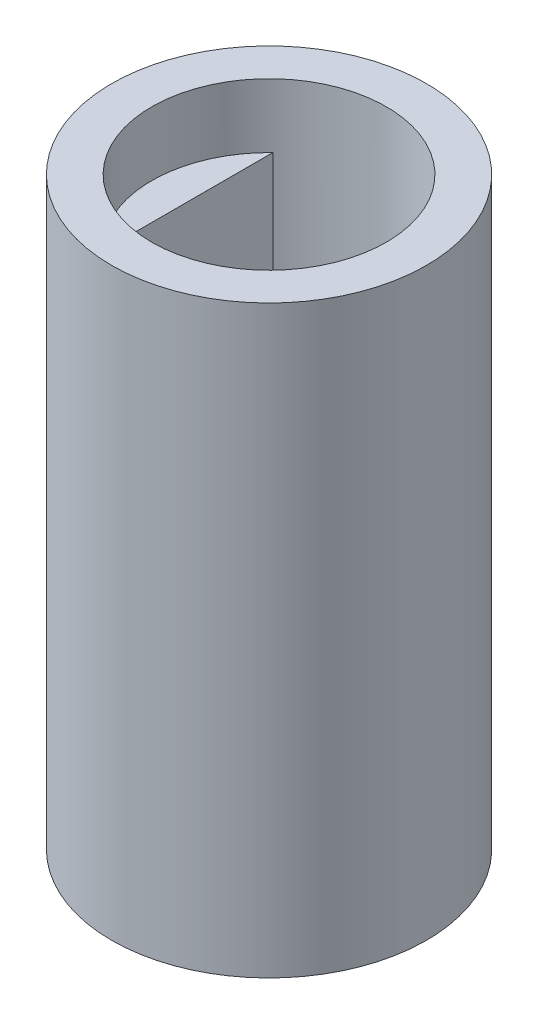
ISO-10303-21;
HEADER;
FILE_DESCRIPTION(('STEP AP214'),'2;1');
FILE_NAME('part.step','',(''),(''),'','','');
FILE_SCHEMA(('AUTOMOTIVE_DESIGN { 1 0 10303 214 1 1 1 1 }'));
ENDSEC;
DATA;
#1=APPLICATION_CONTEXT('core data for automotive mechanical design processes');
#2=APPLICATION_PROTOCOL_DEFINITION('international standard','automotive_design',2000,#1);
#3=PRODUCT_CONTEXT('',#1,'mechanical');
#4=PRODUCT('Part','Part','',(#3));
#5=PRODUCT_RELATED_PRODUCT_CATEGORY('part','',(#4));
#6=PRODUCT_DEFINITION_FORMATION('','',#4);
#7=PRODUCT_DEFINITION_CONTEXT('part definition',#1,'design');
#8=PRODUCT_DEFINITION('design','',#6,#7);
#9=PRODUCT_DEFINITION_SHAPE('','',#8);
#10=(LENGTH_UNIT() NAMED_UNIT(*) SI_UNIT(.MILLI.,.METRE.));
#11=(NAMED_UNIT(*) PLANE_ANGLE_UNIT() SI_UNIT($,.RADIAN.));
#12=(NAMED_UNIT(*) SI_UNIT($,.STERADIAN.) SOLID_ANGLE_UNIT());
#13=UNCERTAINTY_MEASURE_WITH_UNIT(LENGTH_MEASURE(1.E-05),#10,'distance_accuracy_value','');
#14=(GEOMETRIC_REPRESENTATION_CONTEXT(3) GLOBAL_UNCERTAINTY_ASSIGNED_CONTEXT((#13)) GLOBAL_UNIT_ASSIGNED_CONTEXT((#10,
#11,#12)) REPRESENTATION_CONTEXT('',''));
#15=CARTESIAN_POINT('',(0.,0.,0.));
#16=DIRECTION('',(0.,0.,1.));
#17=DIRECTION('',(1.,0.,0.));
#18=AXIS2_PLACEMENT_3D('',#15,#16,#17);
#19=CARTESIAN_POINT('',(-32.2560653814,5.,12.9857265192457));
#20=DIRECTION('',(0.,-1.,0.));
#21=DIRECTION('',(0.,0.,-1.));
#22=AXIS2_PLACEMENT_3D('',#19,#20,#21);
#23=CYLINDRICAL_SURFACE('',#22,0.75);
#24=DIRECTION('',(0.,-1.,0.));
#25=VECTOR('',#24,1.);
#26=CARTESIAN_POINT('',(-31.5060653814,5.,12.9857265192457));
#27=LINE('',#26,#25);
#28=CARTESIAN_POINT('',(-31.5060653814,5.,12.9857265192457));
#29=VERTEX_POINT('',#28);
#30=CARTESIAN_POINT('',(-31.5060653814,0.,12.9857265192457));
#31=VERTEX_POINT('',#30);
#32=EDGE_CURVE('E285',#29,#31,#27,.T.);
#33=ORIENTED_EDGE('',*,*,#32,.F.);
#34=CARTESIAN_POINT('',(-32.2560653814,5.,12.9857265192457));
#35=DIRECTION('',(0.,1.,0.));
#36=DIRECTION('',(0.,0.,1.));
#37=AXIS2_PLACEMENT_3D('',#34,#35,#36);
#38=CIRCLE('',#37,0.75);
#39=CARTESIAN_POINT('',(-32.2560653814,5.,13.7357265192457));
#40=VERTEX_POINT('',#39);
#41=EDGE_CURVE('E39',#40,#29,#38,.T.);
#42=ORIENTED_EDGE('',*,*,#41,.F.);
#43=DIRECTION('',(0.,-1.,0.));
#44=VECTOR('',#43,1.);
#45=CARTESIAN_POINT('',(-32.2560653814,5.,13.7357265192457));
#46=LINE('',#45,#44);
#47=CARTESIAN_POINT('',(-32.2560653814,0.,13.7357265192457));
#48=VERTEX_POINT('',#47);
#49=EDGE_CURVE('E288',#48,#40,#46,.F.);
#50=ORIENTED_EDGE('',*,*,#49,.F.);
#51=CARTESIAN_POINT('',(-32.2560653814,0.,12.9857265192457));
#52=DIRECTION('',(0.,1.,0.));
#53=DIRECTION('',(0.,0.,1.));
#54=AXIS2_PLACEMENT_3D('',#51,#52,#53);
#55=CIRCLE('',#54,0.75);
#56=EDGE_CURVE('E11',#31,#48,#55,.F.);
#57=ORIENTED_EDGE('',*,*,#56,.F.);
#58=EDGE_LOOP('',(#33,#42,#50,#57));
#59=FACE_BOUND('',#58,.T.);
#60=ADVANCED_FACE('F32',(#59),#23,.T.);
#61=CARTESIAN_POINT('',(-28.8560653814,5.,16.3857265192457));
#62=DIRECTION('',(0.,1.,0.));
#63=DIRECTION('',(0.,0.,1.));
#64=AXIS2_PLACEMENT_3D('',#61,#62,#63);
#65=CYLINDRICAL_SURFACE('',#64,0.75);
#66=DIRECTION('',(0.,1.,0.));
#67=VECTOR('',#66,1.);
#68=CARTESIAN_POINT('',(-28.8560653814,5.,15.6357265192457));
#69=LINE('',#68,#67);
#70=CARTESIAN_POINT('',(-28.8560653814,0.,15.6357265192457));
#71=VERTEX_POINT('',#70);
#72=CARTESIAN_POINT('',(-28.8560653814,5.,15.6357265192457));
#73=VERTEX_POINT('',#72);
#74=EDGE_CURVE('E275',#71,#73,#69,.T.);
#75=ORIENTED_EDGE('',*,*,#74,.F.);
#76=CARTESIAN_POINT('',(-28.8560653814,0.,16.3857265192457));
#77=DIRECTION('',(0.,1.,0.));
#78=DIRECTION('',(0.,0.,1.));
#79=AXIS2_PLACEMENT_3D('',#76,#77,#78);
#80=CIRCLE('',#79,0.75);
#81=CARTESIAN_POINT('',(-29.6060653814,0.,16.3857265192457));
#82=VERTEX_POINT('',#81);
#83=EDGE_CURVE('E281',#82,#71,#80,.F.);
#84=ORIENTED_EDGE('',*,*,#83,.F.);
#85=DIRECTION('',(0.,1.,0.));
#86=VECTOR('',#85,1.);
#87=CARTESIAN_POINT('',(-29.6060653814,5.,16.3857265192457));
#88=LINE('',#87,#86);
#89=CARTESIAN_POINT('',(-29.6060653814,5.,16.3857265192457));
#90=VERTEX_POINT('',#89);
#91=EDGE_CURVE('E278',#90,#82,#88,.F.);
#92=ORIENTED_EDGE('',*,*,#91,.F.);
#93=CARTESIAN_POINT('',(-28.8560653814,5.,16.3857265192457));
#94=DIRECTION('',(0.,1.,0.));
#95=DIRECTION('',(0.,0.,1.));
#96=AXIS2_PLACEMENT_3D('',#93,#94,#95);
#97=CIRCLE('',#96,0.75);
#98=EDGE_CURVE('E283',#73,#90,#97,.T.);
#99=ORIENTED_EDGE('',*,*,#98,.F.);
#100=EDGE_LOOP('',(#75,#84,#92,#99));
#101=FACE_BOUND('',#100,.T.);
#102=ADVANCED_FACE('F425',(#101),#65,.T.);
#103=CARTESIAN_POINT('',(-28.8560653814,5.,12.9857265192457));
#104=DIRECTION('',(0.,1.,0.));
#105=DIRECTION('',(0.,0.,1.));
#106=AXIS2_PLACEMENT_3D('',#103,#104,#105);
#107=CYLINDRICAL_SURFACE('',#106,0.75);
#108=DIRECTION('',(0.,-1.,0.));
#109=VECTOR('',#108,1.);
#110=CARTESIAN_POINT('',(-28.8560653814,5.,13.7357265192457));
#111=LINE('',#110,#109);
#112=CARTESIAN_POINT('',(-28.8560653814,5.,13.7357265192457));
#113=VERTEX_POINT('',#112);
#114=CARTESIAN_POINT('',(-28.8560653814,0.,13.7357265192457));
#115=VERTEX_POINT('',#114);
#116=EDGE_CURVE('E265',#113,#115,#111,.T.);
#117=ORIENTED_EDGE('',*,*,#116,.F.);
#118=CARTESIAN_POINT('',(-28.8560653814,5.,12.9857265192457));
#119=DIRECTION('',(0.,1.,0.));
#120=DIRECTION('',(0.,0.,1.));
#121=AXIS2_PLACEMENT_3D('',#118,#119,#120);
#122=CIRCLE('',#121,0.75);
#123=CARTESIAN_POINT('',(-29.6060653814,5.,12.9857265192457));
#124=VERTEX_POINT('',#123);
#125=EDGE_CURVE('E271',#124,#113,#122,.T.);
#126=ORIENTED_EDGE('',*,*,#125,.F.);
#127=DIRECTION('',(0.,-1.,0.));
#128=VECTOR('',#127,1.);
#129=CARTESIAN_POINT('',(-29.6060653814,5.,12.9857265192457));
#130=LINE('',#129,#128);
#131=CARTESIAN_POINT('',(-29.6060653814,0.,12.9857265192457));
#132=VERTEX_POINT('',#131);
#133=EDGE_CURVE('E268',#132,#124,#130,.F.);
#134=ORIENTED_EDGE('',*,*,#133,.F.);
#135=CARTESIAN_POINT('',(-28.8560653814,0.,12.9857265192457));
#136=DIRECTION('',(0.,1.,0.));
#137=DIRECTION('',(0.,0.,1.));
#138=AXIS2_PLACEMENT_3D('',#135,#136,#137);
#139=CIRCLE('',#138,0.75);
#140=EDGE_CURVE('E273',#115,#132,#139,.F.);
#141=ORIENTED_EDGE('',*,*,#140,.F.);
#142=EDGE_LOOP('',(#117,#126,#134,#141));
#143=FACE_BOUND('',#142,.T.);
#144=ADVANCED_FACE('F375',(#143),#107,.T.);
#145=CARTESIAN_POINT('',(-32.2560653814,5.,16.3857265192457));
#146=DIRECTION('',(0.,-1.,0.));
#147=DIRECTION('',(0.,0.,-1.));
#148=AXIS2_PLACEMENT_3D('',#145,#146,#147);
#149=CYLINDRICAL_SURFACE('',#148,0.75);
#150=DIRECTION('',(0.,1.,0.));
#151=VECTOR('',#150,1.);
#152=CARTESIAN_POINT('',(-31.5060653814,5.,16.3857265192457));
#153=LINE('',#152,#151);
#154=CARTESIAN_POINT('',(-31.5060653814,0.,16.3857265192457));
#155=VERTEX_POINT('',#154);
#156=CARTESIAN_POINT('',(-31.5060653814,5.,16.3857265192457));
#157=VERTEX_POINT('',#156);
#158=EDGE_CURVE('E254',#155,#157,#153,.T.);
#159=ORIENTED_EDGE('',*,*,#158,.F.);
#160=CARTESIAN_POINT('',(-32.2560653814,0.,16.3857265192457));
#161=DIRECTION('',(0.,1.,0.));
#162=DIRECTION('',(0.,0.,1.));
#163=AXIS2_PLACEMENT_3D('',#160,#161,#162);
#164=CIRCLE('',#163,0.75);
#165=CARTESIAN_POINT('',(-32.2560653814,0.,15.6357265192457));
#166=VERTEX_POINT('',#165);
#167=EDGE_CURVE('E261',#166,#155,#164,.F.);
#168=ORIENTED_EDGE('',*,*,#167,.F.);
#169=DIRECTION('',(0.,1.,0.));
#170=VECTOR('',#169,1.);
#171=CARTESIAN_POINT('',(-32.2560653814,5.,15.6357265192457));
#172=LINE('',#171,#170);
#173=CARTESIAN_POINT('',(-32.2560653814,5.,15.6357265192457));
#174=VERTEX_POINT('',#173);
#175=EDGE_CURVE('E259',#174,#166,#172,.F.);
#176=ORIENTED_EDGE('',*,*,#175,.F.);
#177=CARTESIAN_POINT('',(-32.2560653814,5.,16.3857265192457));
#178=DIRECTION('',(0.,1.,0.));
#179=DIRECTION('',(0.,0.,1.));
#180=AXIS2_PLACEMENT_3D('',#177,#178,#179);
#181=CIRCLE('',#180,0.75);
#182=EDGE_CURVE('E263',#157,#174,#181,.T.);
#183=ORIENTED_EDGE('',*,*,#182,.F.);
#184=EDGE_LOOP('',(#159,#168,#176,#183));
#185=FACE_BOUND('',#184,.T.);
#186=ADVANCED_FACE('F433',(#185),#149,.T.);
#187=CARTESIAN_POINT('',(0.,5.,0.));
#188=DIRECTION('',(0.,1.,0.));
#189=DIRECTION('',(0.,0.,1.));
#190=AXIS2_PLACEMENT_3D('',#187,#188,#189);
#191=PLANE('',#190);
#192=DIRECTION('',(-1.,0.,0.));
#193=VECTOR('',#192,1.);
#194=CARTESIAN_POINT('',(0.,5.,15.6357265192457));
#195=LINE('',#194,#193);
#196=CARTESIAN_POINT('',(-28.6560653814,5.,15.6357265192457));
#197=VERTEX_POINT('',#196);
#198=EDGE_CURVE('E317',#197,#73,#195,.T.);
#199=ORIENTED_EDGE('',*,*,#198,.T.);
#200=ORIENTED_EDGE('',*,*,#98,.T.);
#201=DIRECTION('',(0.,0.,1.));
#202=VECTOR('',#201,1.);
#203=CARTESIAN_POINT('',(-29.6060653814,5.,0.));
#204=LINE('',#203,#202);
#205=CARTESIAN_POINT('',(-29.6060653814,5.,17.1357265192457));
#206=VERTEX_POINT('',#205);
#207=EDGE_CURVE('E212',#90,#206,#204,.T.);
#208=ORIENTED_EDGE('',*,*,#207,.T.);
#209=DIRECTION('',(-1.,0.,0.));
#210=VECTOR('',#209,1.);
#211=CARTESIAN_POINT('',(0.,5.,17.1357265192457));
#212=LINE('',#211,#210);
#213=CARTESIAN_POINT('',(-31.5060653814,5.,17.1357265192457));
#214=VERTEX_POINT('',#213);
#215=EDGE_CURVE('E207',#206,#214,#212,.T.);
#216=ORIENTED_EDGE('',*,*,#215,.T.);
#217=DIRECTION('',(0.,0.,1.));
#218=VECTOR('',#217,1.);
#219=CARTESIAN_POINT('',(-31.5060653814,5.,0.));
#220=LINE('',#219,#218);
#221=EDGE_CURVE('E190',#157,#214,#220,.T.);
#222=ORIENTED_EDGE('',*,*,#221,.F.);
#223=ORIENTED_EDGE('',*,*,#182,.T.);
#224=DIRECTION('',(-1.,0.,0.));
#225=VECTOR('',#224,1.);
#226=CARTESIAN_POINT('',(0.,5.,15.6357265192457));
#227=LINE('',#226,#225);
#228=CARTESIAN_POINT('',(-32.4560653814,5.,15.6357265192457));
#229=VERTEX_POINT('',#228);
#230=EDGE_CURVE('E189',#174,#229,#227,.T.);
#231=ORIENTED_EDGE('',*,*,#230,.T.);
#232=DIRECTION('',(0.,0.,-1.));
#233=VECTOR('',#232,1.);
#234=CARTESIAN_POINT('',(-32.4560653814,5.,0.));
#235=LINE('',#234,#233);
#236=CARTESIAN_POINT('',(-32.4560653814,5.,16.6738160544529));
#237=VERTEX_POINT('',#236);
#238=EDGE_CURVE('E216',#237,#229,#235,.T.);
#239=ORIENTED_EDGE('',*,*,#238,.F.);
#240=CARTESIAN_POINT('',(-30.5560653814,5.,14.6857265192457));
#241=DIRECTION('',(0.,1.,0.));
#242=DIRECTION('',(0.,0.,1.));
#243=AXIS2_PLACEMENT_3D('',#240,#241,#242);
#244=CIRCLE('',#243,2.75);
#245=CARTESIAN_POINT('',(-28.6560653814,5.,16.6738160544528));
#246=VERTEX_POINT('',#245);
#247=EDGE_CURVE('E218',#237,#246,#244,.T.);
#248=ORIENTED_EDGE('',*,*,#247,.T.);
#249=DIRECTION('',(0.,0.,-1.));
#250=VECTOR('',#249,1.);
#251=CARTESIAN_POINT('',(-28.6560653814,5.,0.));
#252=LINE('',#251,#250);
#253=EDGE_CURVE('E224',#246,#197,#252,.T.);
#254=ORIENTED_EDGE('',*,*,#253,.T.);
#255=EDGE_LOOP('',(#199,#200,#208,#216,#222,#223,#231,#239,#248,#254));
#256=FACE_BOUND('',#255,.T.);
#257=ADVANCED_FACE('F397',(#256),#191,.T.);
#258=CARTESIAN_POINT('',(-30.5560653814,0.,14.6857265192457));
#259=DIRECTION('',(0.,1.,0.));
#260=DIRECTION('',(0.,0.,1.));
#261=AXIS2_PLACEMENT_3D('',#258,#259,#260);
#262=PLANE('',#261);
#263=CARTESIAN_POINT('',(-30.5560653814,0.,14.6857265192457));
#264=DIRECTION('',(0.,1.,0.));
#265=DIRECTION('',(0.,0.,1.));
#266=AXIS2_PLACEMENT_3D('',#263,#264,#265);
#267=CIRCLE('',#266,3.69);
#268=CARTESIAN_POINT('',(-30.5560653814,0.,18.3757265192457));
#269=VERTEX_POINT('',#268);
#270=EDGE_CURVE('E247',#269,#269,#267,.T.);
#271=ORIENTED_EDGE('',*,*,#270,.F.);
#272=EDGE_LOOP('',(#271));
#273=FACE_BOUND('',#272,.T.);
#274=DIRECTION('',(0.,0.,1.));
#275=VECTOR('',#274,1.);
#276=CARTESIAN_POINT('',(-31.5060653814,0.,0.));
#277=LINE('',#276,#275);
#278=CARTESIAN_POINT('',(-31.5060653814,0.,12.2357265192457));
#279=VERTEX_POINT('',#278);
#280=EDGE_CURVE('E329',#279,#31,#277,.T.);
#281=ORIENTED_EDGE('',*,*,#280,.T.);
#282=ORIENTED_EDGE('',*,*,#56,.T.);
#283=DIRECTION('',(-1.,0.,0.));
#284=VECTOR('',#283,1.);
#285=CARTESIAN_POINT('',(0.,0.,13.7357265192457));
#286=LINE('',#285,#284);
#287=CARTESIAN_POINT('',(-33.0060653814,0.,13.7357265192457));
#288=VERTEX_POINT('',#287);
#289=EDGE_CURVE('E327',#48,#288,#286,.T.);
#290=ORIENTED_EDGE('',*,*,#289,.T.);
#291=DIRECTION('',(0.,0.,1.));
#292=VECTOR('',#291,1.);
#293=CARTESIAN_POINT('',(-33.0060653814,0.,0.));
#294=LINE('',#293,#292);
#295=CARTESIAN_POINT('',(-33.0060653814,0.,15.6357265192457));
#296=VERTEX_POINT('',#295);
#297=EDGE_CURVE('E325',#288,#296,#294,.T.);
#298=ORIENTED_EDGE('',*,*,#297,.T.);
#299=DIRECTION('',(-1.,0.,0.));
#300=VECTOR('',#299,1.);
#301=CARTESIAN_POINT('',(0.,0.,15.6357265192457));
#302=LINE('',#301,#300);
#303=EDGE_CURVE('E206',#166,#296,#302,.T.);
#304=ORIENTED_EDGE('',*,*,#303,.F.);
#305=ORIENTED_EDGE('',*,*,#167,.T.);
#306=DIRECTION('',(0.,0.,1.));
#307=VECTOR('',#306,1.);
#308=CARTESIAN_POINT('',(-31.5060653814,0.,0.));
#309=LINE('',#308,#307);
#310=CARTESIAN_POINT('',(-31.5060653814,0.,17.1357265192457));
#311=VERTEX_POINT('',#310);
#312=EDGE_CURVE('E322',#155,#311,#309,.T.);
#313=ORIENTED_EDGE('',*,*,#312,.T.);
#314=DIRECTION('',(-1.,0.,0.));
#315=VECTOR('',#314,1.);
#316=CARTESIAN_POINT('',(0.,0.,17.1357265192457));
#317=LINE('',#316,#315);
#318=CARTESIAN_POINT('',(-29.6060653814,0.,17.1357265192457));
#319=VERTEX_POINT('',#318);
#320=EDGE_CURVE('E348',#319,#311,#317,.T.);
#321=ORIENTED_EDGE('',*,*,#320,.F.);
#322=DIRECTION('',(0.,0.,1.));
#323=VECTOR('',#322,1.);
#324=CARTESIAN_POINT('',(-29.6060653814,0.,0.));
#325=LINE('',#324,#323);
#326=EDGE_CURVE('E346',#82,#319,#325,.T.);
#327=ORIENTED_EDGE('',*,*,#326,.F.);
#328=ORIENTED_EDGE('',*,*,#83,.T.);
#329=DIRECTION('',(-1.,0.,0.));
#330=VECTOR('',#329,1.);
#331=CARTESIAN_POINT('',(0.,0.,15.6357265192457));
#332=LINE('',#331,#330);
#333=CARTESIAN_POINT('',(-28.1060653814,0.,15.6357265192457));
#334=VERTEX_POINT('',#333);
#335=EDGE_CURVE('E343',#334,#71,#332,.T.);
#336=ORIENTED_EDGE('',*,*,#335,.F.);
#337=DIRECTION('',(0.,0.,1.));
#338=VECTOR('',#337,1.);
#339=CARTESIAN_POINT('',(-28.1060653814,0.,0.));
#340=LINE('',#339,#338);
#341=CARTESIAN_POINT('',(-28.1060653814,0.,13.7357265192457));
#342=VERTEX_POINT('',#341);
#343=EDGE_CURVE('E340',#342,#334,#340,.T.);
#344=ORIENTED_EDGE('',*,*,#343,.F.);
#345=DIRECTION('',(-1.,0.,0.));
#346=VECTOR('',#345,1.);
#347=CARTESIAN_POINT('',(0.,0.,13.7357265192457));
#348=LINE('',#347,#346);
#349=EDGE_CURVE('E337',#342,#115,#348,.T.);
#350=ORIENTED_EDGE('',*,*,#349,.T.);
#351=ORIENTED_EDGE('',*,*,#140,.T.);
#352=DIRECTION('',(0.,0.,1.));
#353=VECTOR('',#352,1.);
#354=CARTESIAN_POINT('',(-29.6060653814,0.,0.));
#355=LINE('',#354,#353);
#356=CARTESIAN_POINT('',(-29.6060653814,0.,12.2357265192457));
#357=VERTEX_POINT('',#356);
#358=EDGE_CURVE('E334',#357,#132,#355,.T.);
#359=ORIENTED_EDGE('',*,*,#358,.F.);
#360=DIRECTION('',(-1.,0.,0.));
#361=VECTOR('',#360,1.);
#362=CARTESIAN_POINT('',(0.,0.,12.2357265192457));
#363=LINE('',#362,#361);
#364=EDGE_CURVE('E331',#357,#279,#363,.T.);
#365=ORIENTED_EDGE('',*,*,#364,.T.);
#366=EDGE_LOOP('',(#281,#282,#290,#298,#304,#305,#313,#321,#327,#328,#336,#344,#350,#351,#359,#365));
#367=FACE_BOUND('',#366,.T.);
#368=ADVANCED_FACE('F365',(#273,#367),#262,.F.);
#369=CARTESIAN_POINT('',(-30.5560653814,12.2,14.6857265192457));
#370=DIRECTION('',(0.,1.,0.));
#371=DIRECTION('',(0.,0.,1.));
#372=AXIS2_PLACEMENT_3D('',#369,#370,#371);
#373=PLANE('',#372);
#374=CARTESIAN_POINT('',(-30.5560653814,12.2,14.6857265192457));
#375=DIRECTION('',(0.,1.,0.));
#376=DIRECTION('',(0.,0.,1.));
#377=AXIS2_PLACEMENT_3D('',#374,#375,#376);
#378=CIRCLE('',#377,2.75);
#379=CARTESIAN_POINT('',(-32.4560653814,12.2,12.6976369840386));
#380=VERTEX_POINT('',#379);
#381=CARTESIAN_POINT('',(-32.4560653814,12.2,16.6738160544529));
#382=VERTEX_POINT('',#381);
#383=EDGE_CURVE('E248',#380,#382,#378,.T.);
#384=ORIENTED_EDGE('',*,*,#383,.T.);
#385=DIRECTION('',(0.,0.,-1.));
#386=VECTOR('',#385,1.);
#387=CARTESIAN_POINT('',(-32.4560653814,12.2,0.));
#388=LINE('',#387,#386);
#389=EDGE_CURVE('E228',#382,#380,#388,.T.);
#390=ORIENTED_EDGE('',*,*,#389,.T.);
#391=EDGE_LOOP('',(#384,#390));
#392=FACE_BOUND('',#391,.T.);
#393=ADVANCED_FACE('F412',(#392),#373,.T.);
#394=CARTESIAN_POINT('',(-30.5560653814,13.7,14.6857265192457));
#395=DIRECTION('',(0.,-1.,0.));
#396=DIRECTION('',(0.,0.,-1.));
#397=AXIS2_PLACEMENT_3D('',#394,#395,#396);
#398=CYLINDRICAL_SURFACE('',#397,3.69);
#399=CARTESIAN_POINT('',(-30.5560653814,13.7,14.6857265192457));
#400=DIRECTION('',(0.,1.,0.));
#401=DIRECTION('',(0.,0.,1.));
#402=AXIS2_PLACEMENT_3D('',#399,#400,#401);
#403=CIRCLE('',#402,3.69);
#404=CARTESIAN_POINT('',(-30.5560653814,13.7,18.3757265192457));
#405=VERTEX_POINT('',#404);
#406=EDGE_CURVE('E251',#405,#405,#403,.T.);
#407=ORIENTED_EDGE('',*,*,#406,.F.);
#408=EDGE_LOOP('',(#407));
#409=FACE_BOUND('',#408,.T.);
#410=ORIENTED_EDGE('',*,*,#270,.T.);
#411=EDGE_LOOP('',(#410));
#412=FACE_BOUND('',#411,.T.);
#413=ADVANCED_FACE('F422',(#409,#412),#398,.T.);
#414=CARTESIAN_POINT('',(-30.5560653814,13.7,14.6857265192457));
#415=DIRECTION('',(0.,1.,0.));
#416=DIRECTION('',(0.,0.,1.));
#417=AXIS2_PLACEMENT_3D('',#414,#415,#416);
#418=PLANE('',#417);
#419=CARTESIAN_POINT('',(-30.5560653814,13.7,14.6857265192457));
#420=DIRECTION('',(0.,1.,0.));
#421=DIRECTION('',(0.,0.,1.));
#422=AXIS2_PLACEMENT_3D('',#419,#420,#421);
#423=CIRCLE('',#422,2.75);
#424=CARTESIAN_POINT('',(-30.5560653814,13.7,17.4357265192457));
#425=VERTEX_POINT('',#424);
#426=EDGE_CURVE('E237',#425,#425,#423,.T.);
#427=ORIENTED_EDGE('',*,*,#426,.F.);
#428=EDGE_LOOP('',(#427));
#429=FACE_BOUND('',#428,.T.);
#430=ORIENTED_EDGE('',*,*,#406,.T.);
#431=EDGE_LOOP('',(#430));
#432=FACE_BOUND('',#431,.T.);
#433=ADVANCED_FACE('F419',(#429,#432),#418,.T.);
#434=CARTESIAN_POINT('',(-30.5560653814,12.2,14.6857265192457));
#435=DIRECTION('',(0.,1.,0.));
#436=DIRECTION('',(0.,0.,1.));
#437=AXIS2_PLACEMENT_3D('',#434,#435,#436);
#438=CYLINDRICAL_SURFACE('',#437,2.75);
#439=CARTESIAN_POINT('',(-28.6560653814,12.2,16.6738160544528));
#440=VERTEX_POINT('',#439);
#441=CARTESIAN_POINT('',(-28.6560653814,12.2,12.6976369840386));
#442=VERTEX_POINT('',#441);
#443=EDGE_CURVE('E244',#440,#442,#378,.T.);
#444=ORIENTED_EDGE('',*,*,#443,.F.);
#445=DIRECTION('',(0.,1.,0.));
#446=VECTOR('',#445,1.);
#447=CARTESIAN_POINT('',(-28.6560653814,5.,16.6738160544528));
#448=LINE('',#447,#446);
#449=EDGE_CURVE('E240',#246,#440,#448,.T.);
#450=ORIENTED_EDGE('',*,*,#449,.F.);
#451=ORIENTED_EDGE('',*,*,#247,.F.);
#452=DIRECTION('',(0.,1.,0.));
#453=VECTOR('',#452,1.);
#454=CARTESIAN_POINT('',(-32.4560653814,5.,16.6738160544529));
#455=LINE('',#454,#453);
#456=EDGE_CURVE('E242',#237,#382,#455,.T.);
#457=ORIENTED_EDGE('',*,*,#456,.T.);
#458=ORIENTED_EDGE('',*,*,#383,.F.);
#459=DIRECTION('',(0.,1.,0.));
#460=VECTOR('',#459,1.);
#461=CARTESIAN_POINT('',(-32.4560653814,5.,12.6976369840386));
#462=LINE('',#461,#460);
#463=CARTESIAN_POINT('',(-32.4560653814,5.,12.6976369840386));
#464=VERTEX_POINT('',#463);
#465=EDGE_CURVE('E235',#464,#380,#462,.T.);
#466=ORIENTED_EDGE('',*,*,#465,.F.);
#467=CARTESIAN_POINT('',(-28.6560653814,5.,12.6976369840386));
#468=VERTEX_POINT('',#467);
#469=EDGE_CURVE('E223',#468,#464,#244,.T.);
#470=ORIENTED_EDGE('',*,*,#469,.F.);
#471=DIRECTION('',(0.,1.,0.));
#472=VECTOR('',#471,1.);
#473=CARTESIAN_POINT('',(-28.6560653814,5.,12.6976369840386));
#474=LINE('',#473,#472);
#475=EDGE_CURVE('E238',#468,#442,#474,.T.);
#476=ORIENTED_EDGE('',*,*,#475,.T.);
#477=EDGE_LOOP('',(#444,#450,#451,#457,#458,#466,#470,#476));
#478=FACE_BOUND('',#477,.T.);
#479=ORIENTED_EDGE('',*,*,#426,.T.);
#480=EDGE_LOOP('',(#479));
#481=FACE_BOUND('',#480,.T.);
#482=ADVANCED_FACE('F402',(#478,#481),#438,.F.);
#483=DIRECTION('',(0.,0.,-1.));
#484=VECTOR('',#483,1.);
#485=CARTESIAN_POINT('',(-28.6560653814,12.2,0.));
#486=LINE('',#485,#484);
#487=EDGE_CURVE('E231',#440,#442,#486,.T.);
#488=ORIENTED_EDGE('',*,*,#487,.F.);
#489=ORIENTED_EDGE('',*,*,#443,.T.);
#490=EDGE_LOOP('',(#488,#489));
#491=FACE_BOUND('',#490,.T.);
#492=ADVANCED_FACE('F408',(#491),#373,.T.);
#493=CARTESIAN_POINT('',(-32.4560653814,5.,0.));
#494=DIRECTION('',(1.,0.,0.));
#495=DIRECTION('',(0.,0.,-1.));
#496=AXIS2_PLACEMENT_3D('',#493,#494,#495);
#497=PLANE('',#496);
#498=ORIENTED_EDGE('',*,*,#389,.F.);
#499=ORIENTED_EDGE('',*,*,#456,.F.);
#500=ORIENTED_EDGE('',*,*,#238,.T.);
#501=CARTESIAN_POINT('',(-32.4560653814,5.,13.7357265192457));
#502=VERTEX_POINT('',#501);
#503=EDGE_CURVE('E184',#229,#502,#235,.T.);
#504=ORIENTED_EDGE('',*,*,#503,.T.);
#505=EDGE_CURVE('E219',#502,#464,#235,.T.);
#506=ORIENTED_EDGE('',*,*,#505,.T.);
#507=ORIENTED_EDGE('',*,*,#465,.T.);
#508=EDGE_LOOP('',(#498,#499,#500,#504,#506,#507));
#509=FACE_BOUND('',#508,.T.);
#510=ADVANCED_FACE('F410',(#509),#497,.T.);
#511=CARTESIAN_POINT('',(-28.6560653814,5.,0.));
#512=DIRECTION('',(1.,0.,0.));
#513=DIRECTION('',(0.,0.,-1.));
#514=AXIS2_PLACEMENT_3D('',#511,#512,#513);
#515=PLANE('',#514);
#516=ORIENTED_EDGE('',*,*,#487,.T.);
#517=ORIENTED_EDGE('',*,*,#475,.F.);
#518=CARTESIAN_POINT('',(-28.6560653814,5.,13.7357265192457));
#519=VERTEX_POINT('',#518);
#520=EDGE_CURVE('E222',#519,#468,#252,.T.);
#521=ORIENTED_EDGE('',*,*,#520,.F.);
#522=EDGE_CURVE('E227',#197,#519,#252,.T.);
#523=ORIENTED_EDGE('',*,*,#522,.F.);
#524=ORIENTED_EDGE('',*,*,#253,.F.);
#525=ORIENTED_EDGE('',*,*,#449,.T.);
#526=EDGE_LOOP('',(#516,#517,#521,#523,#524,#525));
#527=FACE_BOUND('',#526,.T.);
#528=ADVANCED_FACE('F394',(#527),#515,.F.);
#529=DIRECTION('',(-1.,0.,0.));
#530=VECTOR('',#529,1.);
#531=CARTESIAN_POINT('',(0.,5.,13.7357265192457));
#532=LINE('',#531,#530);
#533=EDGE_CURVE('E297',#40,#502,#532,.T.);
#534=ORIENTED_EDGE('',*,*,#533,.F.);
#535=ORIENTED_EDGE('',*,*,#41,.T.);
#536=DIRECTION('',(0.,0.,1.));
#537=VECTOR('',#536,1.);
#538=CARTESIAN_POINT('',(-31.5060653814,5.,0.));
#539=LINE('',#538,#537);
#540=CARTESIAN_POINT('',(-31.5060653814,5.,12.2357265192457));
#541=VERTEX_POINT('',#540);
#542=EDGE_CURVE('E295',#541,#29,#539,.T.);
#543=ORIENTED_EDGE('',*,*,#542,.F.);
#544=DIRECTION('',(-1.,0.,0.));
#545=VECTOR('',#544,1.);
#546=CARTESIAN_POINT('',(0.,5.,12.2357265192457));
#547=LINE('',#546,#545);
#548=CARTESIAN_POINT('',(-29.6060653814,5.,12.2357265192457));
#549=VERTEX_POINT('',#548);
#550=EDGE_CURVE('E302',#549,#541,#547,.T.);
#551=ORIENTED_EDGE('',*,*,#550,.F.);
#552=DIRECTION('',(0.,0.,1.));
#553=VECTOR('',#552,1.);
#554=CARTESIAN_POINT('',(-29.6060653814,5.,0.));
#555=LINE('',#554,#553);
#556=EDGE_CURVE('E304',#549,#124,#555,.T.);
#557=ORIENTED_EDGE('',*,*,#556,.T.);
#558=ORIENTED_EDGE('',*,*,#125,.T.);
#559=DIRECTION('',(-1.,0.,0.));
#560=VECTOR('',#559,1.);
#561=CARTESIAN_POINT('',(0.,5.,13.7357265192457));
#562=LINE('',#561,#560);
#563=EDGE_CURVE('E310',#519,#113,#562,.T.);
#564=ORIENTED_EDGE('',*,*,#563,.F.);
#565=ORIENTED_EDGE('',*,*,#520,.T.);
#566=ORIENTED_EDGE('',*,*,#469,.T.);
#567=ORIENTED_EDGE('',*,*,#505,.F.);
#568=EDGE_LOOP('',(#534,#535,#543,#551,#557,#558,#564,#565,#566,#567));
#569=FACE_BOUND('',#568,.T.);
#570=ADVANCED_FACE('F292',(#569),#191,.T.);
#571=CARTESIAN_POINT('',(0.,5.,0.));
#572=DIRECTION('',(0.,-1.,0.));
#573=DIRECTION('',(0.,0.,-1.));
#574=AXIS2_PLACEMENT_3D('',#571,#572,#573);
#575=PLANE('',#574);
#576=ORIENTED_EDGE('',*,*,#522,.T.);
#577=CARTESIAN_POINT('',(-28.1060653814,5.,13.7357265192457));
#578=VERTEX_POINT('',#577);
#579=EDGE_CURVE('E311',#578,#519,#562,.T.);
#580=ORIENTED_EDGE('',*,*,#579,.F.);
#581=DIRECTION('',(0.,0.,1.));
#582=VECTOR('',#581,1.);
#583=CARTESIAN_POINT('',(-28.1060653814,5.,0.));
#584=LINE('',#583,#582);
#585=CARTESIAN_POINT('',(-28.1060653814,5.,15.6357265192457));
#586=VERTEX_POINT('',#585);
#587=EDGE_CURVE('E314',#578,#586,#584,.T.);
#588=ORIENTED_EDGE('',*,*,#587,.T.);
#589=EDGE_CURVE('E318',#586,#197,#195,.T.);
#590=ORIENTED_EDGE('',*,*,#589,.T.);
#591=EDGE_LOOP('',(#576,#580,#588,#590));
#592=FACE_BOUND('',#591,.T.);
#593=ADVANCED_FACE('F382',(#592),#575,.T.);
#594=CARTESIAN_POINT('',(-31.5060653814,5.,0.));
#595=DIRECTION('',(1.,0.,0.));
#596=DIRECTION('',(0.,0.,-1.));
#597=AXIS2_PLACEMENT_3D('',#594,#595,#596);
#598=PLANE('',#597);
#599=ORIENTED_EDGE('',*,*,#312,.F.);
#600=ORIENTED_EDGE('',*,*,#158,.T.);
#601=ORIENTED_EDGE('',*,*,#221,.T.);
#602=DIRECTION('',(0.,-1.,0.));
#603=VECTOR('',#602,1.);
#604=CARTESIAN_POINT('',(-31.5060653814,5.,17.1357265192457));
#605=LINE('',#604,#603);
#606=EDGE_CURVE('E232',#214,#311,#605,.T.);
#607=ORIENTED_EDGE('',*,*,#606,.T.);
#608=EDGE_LOOP('',(#599,#600,#601,#607));
#609=FACE_BOUND('',#608,.T.);
#610=ADVANCED_FACE('F495',(#609),#598,.T.);
#611=CARTESIAN_POINT('',(0.,5.,17.1357265192457));
#612=DIRECTION('',(0.,0.,1.));
#613=DIRECTION('',(1.,0.,0.));
#614=AXIS2_PLACEMENT_3D('',#611,#612,#613);
#615=PLANE('',#614);
#616=ORIENTED_EDGE('',*,*,#320,.T.);
#617=ORIENTED_EDGE('',*,*,#606,.F.);
#618=ORIENTED_EDGE('',*,*,#215,.F.);
#619=DIRECTION('',(0.,-1.,0.));
#620=VECTOR('',#619,1.);
#621=CARTESIAN_POINT('',(-29.6060653814,5.,17.1357265192457));
#622=LINE('',#621,#620);
#623=EDGE_CURVE('E353',#206,#319,#622,.T.);
#624=ORIENTED_EDGE('',*,*,#623,.T.);
#625=EDGE_LOOP('',(#616,#617,#618,#624));
#626=FACE_BOUND('',#625,.T.);
#627=ADVANCED_FACE('F503',(#626),#615,.F.);
#628=CARTESIAN_POINT('',(-29.6060653814,5.,0.));
#629=DIRECTION('',(1.,0.,0.));
#630=DIRECTION('',(0.,0.,-1.));
#631=AXIS2_PLACEMENT_3D('',#628,#629,#630);
#632=PLANE('',#631);
#633=ORIENTED_EDGE('',*,*,#207,.F.);
#634=ORIENTED_EDGE('',*,*,#91,.T.);
#635=ORIENTED_EDGE('',*,*,#326,.T.);
#636=ORIENTED_EDGE('',*,*,#623,.F.);
#637=EDGE_LOOP('',(#633,#634,#635,#636));
#638=FACE_BOUND('',#637,.T.);
#639=ADVANCED_FACE('F508',(#638),#632,.F.);
#640=CARTESIAN_POINT('',(0.,5.,15.6357265192457));
#641=DIRECTION('',(0.,0.,1.));
#642=DIRECTION('',(1.,0.,0.));
#643=AXIS2_PLACEMENT_3D('',#640,#641,#642);
#644=PLANE('',#643);
#645=ORIENTED_EDGE('',*,*,#335,.T.);
#646=ORIENTED_EDGE('',*,*,#74,.T.);
#647=ORIENTED_EDGE('',*,*,#198,.F.);
#648=ORIENTED_EDGE('',*,*,#589,.F.);
#649=DIRECTION('',(0.,-1.,0.));
#650=VECTOR('',#649,1.);
#651=CARTESIAN_POINT('',(-28.1060653814,5.,15.6357265192457));
#652=LINE('',#651,#650);
#653=EDGE_CURVE('E356',#586,#334,#652,.T.);
#654=ORIENTED_EDGE('',*,*,#653,.T.);
#655=EDGE_LOOP('',(#645,#646,#647,#648,#654));
#656=FACE_BOUND('',#655,.T.);
#657=ADVANCED_FACE('F390',(#656),#644,.F.);
#658=CARTESIAN_POINT('',(-28.1060653814,5.,0.));
#659=DIRECTION('',(1.,0.,0.));
#660=DIRECTION('',(0.,0.,-1.));
#661=AXIS2_PLACEMENT_3D('',#658,#659,#660);
#662=PLANE('',#661);
#663=ORIENTED_EDGE('',*,*,#343,.T.);
#664=ORIENTED_EDGE('',*,*,#653,.F.);
#665=ORIENTED_EDGE('',*,*,#587,.F.);
#666=DIRECTION('',(0.,-1.,0.));
#667=VECTOR('',#666,1.);
#668=CARTESIAN_POINT('',(-28.1060653814,5.,13.7357265192457));
#669=LINE('',#668,#667);
#670=EDGE_CURVE('E358',#578,#342,#669,.T.);
#671=ORIENTED_EDGE('',*,*,#670,.T.);
#672=EDGE_LOOP('',(#663,#664,#665,#671));
#673=FACE_BOUND('',#672,.T.);
#674=ADVANCED_FACE('F385',(#673),#662,.F.);
#675=CARTESIAN_POINT('',(0.,5.,13.7357265192457));
#676=DIRECTION('',(0.,0.,1.));
#677=DIRECTION('',(1.,0.,0.));
#678=AXIS2_PLACEMENT_3D('',#675,#676,#677);
#679=PLANE('',#678);
#680=ORIENTED_EDGE('',*,*,#563,.T.);
#681=ORIENTED_EDGE('',*,*,#116,.T.);
#682=ORIENTED_EDGE('',*,*,#349,.F.);
#683=ORIENTED_EDGE('',*,*,#670,.F.);
#684=ORIENTED_EDGE('',*,*,#579,.T.);
#685=EDGE_LOOP('',(#680,#681,#682,#683,#684));
#686=FACE_BOUND('',#685,.T.);
#687=ADVANCED_FACE('F378',(#686),#679,.T.);
#688=CARTESIAN_POINT('',(-29.6060653814,5.,0.));
#689=DIRECTION('',(1.,0.,0.));
#690=DIRECTION('',(0.,0.,-1.));
#691=AXIS2_PLACEMENT_3D('',#688,#689,#690);
#692=PLANE('',#691);
#693=ORIENTED_EDGE('',*,*,#358,.T.);
#694=ORIENTED_EDGE('',*,*,#133,.T.);
#695=ORIENTED_EDGE('',*,*,#556,.F.);
#696=DIRECTION('',(0.,-1.,0.));
#697=VECTOR('',#696,1.);
#698=CARTESIAN_POINT('',(-29.6060653814,5.,12.2357265192457));
#699=LINE('',#698,#697);
#700=EDGE_CURVE('E360',#549,#357,#699,.T.);
#701=ORIENTED_EDGE('',*,*,#700,.T.);
#702=EDGE_LOOP('',(#693,#694,#695,#701));
#703=FACE_BOUND('',#702,.T.);
#704=ADVANCED_FACE('F368',(#703),#692,.F.);
#705=CARTESIAN_POINT('',(0.,5.,12.2357265192457));
#706=DIRECTION('',(0.,0.,1.));
#707=DIRECTION('',(1.,0.,0.));
#708=AXIS2_PLACEMENT_3D('',#705,#706,#707);
#709=PLANE('',#708);
#710=ORIENTED_EDGE('',*,*,#364,.F.);
#711=ORIENTED_EDGE('',*,*,#700,.F.);
#712=ORIENTED_EDGE('',*,*,#550,.T.);
#713=DIRECTION('',(0.,-1.,0.));
#714=VECTOR('',#713,1.);
#715=CARTESIAN_POINT('',(-31.5060653814,5.,12.2357265192457));
#716=LINE('',#715,#714);
#717=EDGE_CURVE('E209',#541,#279,#716,.T.);
#718=ORIENTED_EDGE('',*,*,#717,.T.);
#719=EDGE_LOOP('',(#710,#711,#712,#718));
#720=FACE_BOUND('',#719,.T.);
#721=ADVANCED_FACE('F363',(#720),#709,.T.);
#722=CARTESIAN_POINT('',(-31.5060653814,5.,0.));
#723=DIRECTION('',(1.,0.,0.));
#724=DIRECTION('',(0.,0.,-1.));
#725=AXIS2_PLACEMENT_3D('',#722,#723,#724);
#726=PLANE('',#725);
#727=ORIENTED_EDGE('',*,*,#542,.T.);
#728=ORIENTED_EDGE('',*,*,#32,.T.);
#729=ORIENTED_EDGE('',*,*,#280,.F.);
#730=ORIENTED_EDGE('',*,*,#717,.F.);
#731=EDGE_LOOP('',(#727,#728,#729,#730));
#732=FACE_BOUND('',#731,.T.);
#733=ADVANCED_FACE('F301',(#732),#726,.T.);
#734=CARTESIAN_POINT('',(0.,5.,13.7357265192457));
#735=DIRECTION('',(0.,0.,1.));
#736=DIRECTION('',(1.,0.,0.));
#737=AXIS2_PLACEMENT_3D('',#734,#735,#736);
#738=PLANE('',#737);
#739=ORIENTED_EDGE('',*,*,#289,.F.);
#740=ORIENTED_EDGE('',*,*,#49,.T.);
#741=ORIENTED_EDGE('',*,*,#533,.T.);
#742=CARTESIAN_POINT('',(-33.0060653814,5.,13.7357265192457));
#743=VERTEX_POINT('',#742);
#744=EDGE_CURVE('E201',#502,#743,#532,.T.);
#745=ORIENTED_EDGE('',*,*,#744,.T.);
#746=DIRECTION('',(0.,-1.,0.));
#747=VECTOR('',#746,1.);
#748=CARTESIAN_POINT('',(-33.0060653814,5.,13.7357265192457));
#749=LINE('',#748,#747);
#750=EDGE_CURVE('E200',#743,#288,#749,.T.);
#751=ORIENTED_EDGE('',*,*,#750,.T.);
#752=EDGE_LOOP('',(#739,#740,#741,#745,#751));
#753=FACE_BOUND('',#752,.T.);
#754=ADVANCED_FACE('F544',(#753),#738,.T.);
#755=CARTESIAN_POINT('',(-33.0060653814,5.,0.));
#756=DIRECTION('',(1.,0.,0.));
#757=DIRECTION('',(0.,0.,-1.));
#758=AXIS2_PLACEMENT_3D('',#755,#756,#757);
#759=PLANE('',#758);
#760=ORIENTED_EDGE('',*,*,#297,.F.);
#761=ORIENTED_EDGE('',*,*,#750,.F.);
#762=DIRECTION('',(0.,0.,1.));
#763=VECTOR('',#762,1.);
#764=CARTESIAN_POINT('',(-33.0060653814,5.,0.));
#765=LINE('',#764,#763);
#766=CARTESIAN_POINT('',(-33.0060653814,5.,15.6357265192457));
#767=VERTEX_POINT('',#766);
#768=EDGE_CURVE('E182',#743,#767,#765,.T.);
#769=ORIENTED_EDGE('',*,*,#768,.T.);
#770=DIRECTION('',(0.,-1.,0.));
#771=VECTOR('',#770,1.);
#772=CARTESIAN_POINT('',(-33.0060653814,5.,15.6357265192457));
#773=LINE('',#772,#771);
#774=EDGE_CURVE('E197',#767,#296,#773,.T.);
#775=ORIENTED_EDGE('',*,*,#774,.T.);
#776=EDGE_LOOP('',(#760,#761,#769,#775));
#777=FACE_BOUND('',#776,.T.);
#778=ADVANCED_FACE('F196',(#777),#759,.T.);
#779=CARTESIAN_POINT('',(0.,5.,15.6357265192457));
#780=DIRECTION('',(0.,0.,1.));
#781=DIRECTION('',(1.,0.,0.));
#782=AXIS2_PLACEMENT_3D('',#779,#780,#781);
#783=PLANE('',#782);
#784=ORIENTED_EDGE('',*,*,#230,.F.);
#785=ORIENTED_EDGE('',*,*,#175,.T.);
#786=ORIENTED_EDGE('',*,*,#303,.T.);
#787=ORIENTED_EDGE('',*,*,#774,.F.);
#788=EDGE_CURVE('E178',#229,#767,#227,.T.);
#789=ORIENTED_EDGE('',*,*,#788,.F.);
#790=EDGE_LOOP('',(#784,#785,#786,#787,#789));
#791=FACE_BOUND('',#790,.T.);
#792=ADVANCED_FACE('F203',(#791),#783,.F.);
#793=ORIENTED_EDGE('',*,*,#788,.T.);
#794=ORIENTED_EDGE('',*,*,#768,.F.);
#795=ORIENTED_EDGE('',*,*,#744,.F.);
#796=ORIENTED_EDGE('',*,*,#503,.F.);
#797=EDGE_LOOP('',(#793,#794,#795,#796));
#798=FACE_BOUND('',#797,.T.);
#799=ADVANCED_FACE('F180',(#798),#575,.T.);
#800=CLOSED_SHELL('',(#60,#102,#144,#186,#257,#368,#393,#413,#433,#482,#492,#510,#528,#570,#593,
#610,#627,#639,#657,#674,#687,#704,#721,#733,#754,#778,#792,#799));
#801=MANIFOLD_SOLID_BREP('B2',#800);
#802=ADVANCED_BREP_SHAPE_REPRESENTATION('',(#18,#801),#14);
#803=SHAPE_DEFINITION_REPRESENTATION(#9,#802);
ENDSEC;
END-ISO-10303-21;
